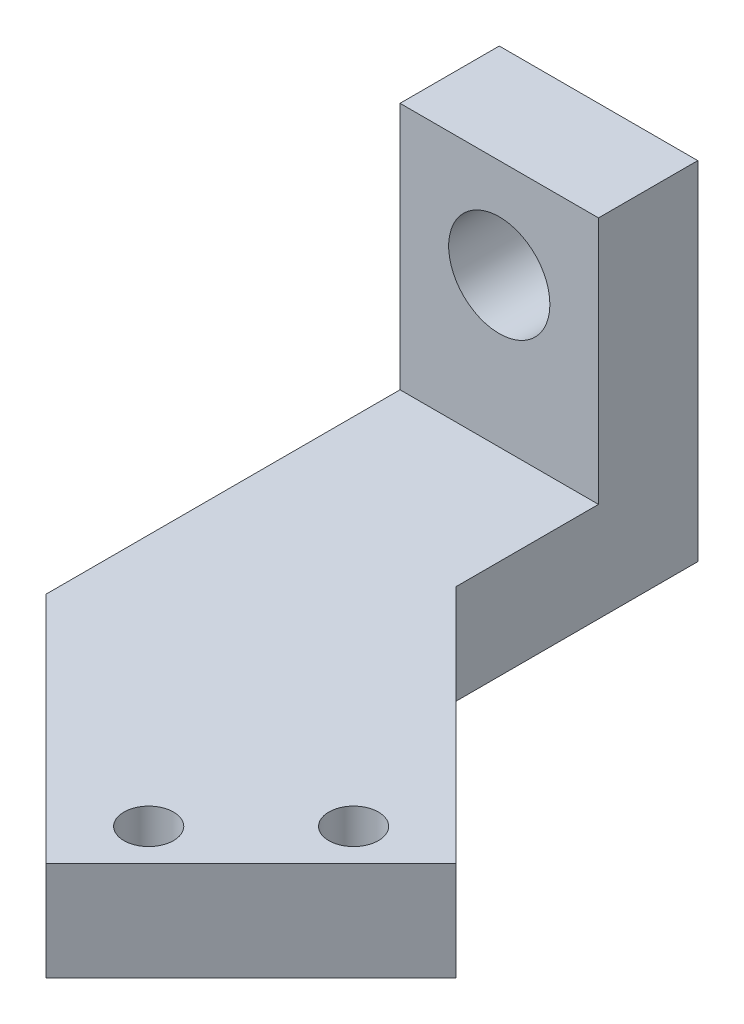
ISO-10303-21;
HEADER;
FILE_DESCRIPTION(('STEP AP214'),'2;1');
FILE_NAME('part.step','',(''),(''),'','','');
FILE_SCHEMA(('AUTOMOTIVE_DESIGN { 1 0 10303 214 1 1 1 1 }'));
ENDSEC;
DATA;
#1=APPLICATION_CONTEXT('core data for automotive mechanical design processes');
#2=APPLICATION_PROTOCOL_DEFINITION('international standard','automotive_design',2000,#1);
#3=PRODUCT_CONTEXT('',#1,'mechanical');
#4=PRODUCT('Part','Part','',(#3));
#5=PRODUCT_RELATED_PRODUCT_CATEGORY('part','',(#4));
#6=PRODUCT_DEFINITION_FORMATION('','',#4);
#7=PRODUCT_DEFINITION_CONTEXT('part definition',#1,'design');
#8=PRODUCT_DEFINITION('design','',#6,#7);
#9=PRODUCT_DEFINITION_SHAPE('','',#8);
#10=(LENGTH_UNIT() NAMED_UNIT(*) SI_UNIT(.MILLI.,.METRE.));
#11=(NAMED_UNIT(*) PLANE_ANGLE_UNIT() SI_UNIT($,.RADIAN.));
#12=(NAMED_UNIT(*) SI_UNIT($,.STERADIAN.) SOLID_ANGLE_UNIT());
#13=UNCERTAINTY_MEASURE_WITH_UNIT(LENGTH_MEASURE(1.E-05),#10,'distance_accuracy_value','');
#14=(GEOMETRIC_REPRESENTATION_CONTEXT(3) GLOBAL_UNCERTAINTY_ASSIGNED_CONTEXT((#13)) GLOBAL_UNIT_ASSIGNED_CONTEXT((#10,
#11,#12)) REPRESENTATION_CONTEXT('',''));
#15=CARTESIAN_POINT('',(0.,0.,0.));
#16=DIRECTION('',(0.,0.,1.));
#17=DIRECTION('',(1.,0.,0.));
#18=AXIS2_PLACEMENT_3D('',#15,#16,#17);
#19=CARTESIAN_POINT('',(0.,0.,10.));
#20=DIRECTION('',(0.,0.,1.));
#21=DIRECTION('',(1.,0.,0.));
#22=AXIS2_PLACEMENT_3D('',#19,#20,#21);
#23=PLANE('',#22);
#24=DIRECTION('',(0.,-1.,0.));
#25=VECTOR('',#24,1.);
#26=CARTESIAN_POINT('',(-10.,-10.,10.));
#27=LINE('',#26,#25);
#28=CARTESIAN_POINT('',(-10.,10.,10.));
#29=VERTEX_POINT('',#28);
#30=CARTESIAN_POINT('',(-10.,-15.,10.));
#31=VERTEX_POINT('',#30);
#32=EDGE_CURVE('E104',#29,#31,#27,.T.);
#33=ORIENTED_EDGE('',*,*,#32,.T.);
#34=DIRECTION('',(1.,0.,0.));
#35=VECTOR('',#34,1.);
#36=CARTESIAN_POINT('',(-10.,-15.,10.));
#37=LINE('',#36,#35);
#38=CARTESIAN_POINT('',(10.,-15.,10.));
#39=VERTEX_POINT('',#38);
#40=EDGE_CURVE('E116',#31,#39,#37,.T.);
#41=ORIENTED_EDGE('',*,*,#40,.T.);
#42=DIRECTION('',(0.,1.,0.));
#43=VECTOR('',#42,1.);
#44=CARTESIAN_POINT('',(10.,-15.,10.));
#45=LINE('',#44,#43);
#46=CARTESIAN_POINT('',(10.,10.,10.));
#47=VERTEX_POINT('',#46);
#48=EDGE_CURVE('E109',#39,#47,#45,.T.);
#49=ORIENTED_EDGE('',*,*,#48,.T.);
#50=DIRECTION('',(-1.,0.,0.));
#51=VECTOR('',#50,1.);
#52=CARTESIAN_POINT('',(10.,10.,10.));
#53=LINE('',#52,#51);
#54=EDGE_CURVE('E72',#47,#29,#53,.T.);
#55=ORIENTED_EDGE('',*,*,#54,.T.);
#56=EDGE_LOOP('',(#33,#41,#49,#55));
#57=FACE_BOUND('',#56,.T.);
#58=CARTESIAN_POINT('',(0.,0.,10.));
#59=DIRECTION('',(0.,0.,1.));
#60=DIRECTION('',(1.,0.,0.));
#61=AXIS2_PLACEMENT_3D('',#58,#59,#60);
#62=CIRCLE('',#61,5.1);
#63=CARTESIAN_POINT('',(5.1,0.,10.));
#64=VERTEX_POINT('',#63);
#65=EDGE_CURVE('E97',#64,#64,#62,.T.);
#66=ORIENTED_EDGE('',*,*,#65,.F.);
#67=EDGE_LOOP('',(#66));
#68=FACE_BOUND('',#67,.T.);
#69=ADVANCED_FACE('F47',(#57,#68),#23,.T.);
#70=CARTESIAN_POINT('',(0.,0.,0.));
#71=DIRECTION('',(0.,0.,1.));
#72=DIRECTION('',(1.,0.,0.));
#73=AXIS2_PLACEMENT_3D('',#70,#71,#72);
#74=PLANE('',#73);
#75=DIRECTION('',(0.,-1.,0.));
#76=VECTOR('',#75,1.);
#77=CARTESIAN_POINT('',(-10.,-10.,0.));
#78=LINE('',#77,#76);
#79=CARTESIAN_POINT('',(-10.,10.,0.));
#80=VERTEX_POINT('',#79);
#81=CARTESIAN_POINT('',(-10.,-25.,0.));
#82=VERTEX_POINT('',#81);
#83=EDGE_CURVE('E85',#80,#82,#78,.T.);
#84=ORIENTED_EDGE('',*,*,#83,.F.);
#85=DIRECTION('',(-1.,0.,0.));
#86=VECTOR('',#85,1.);
#87=CARTESIAN_POINT('',(10.,10.,0.));
#88=LINE('',#87,#86);
#89=CARTESIAN_POINT('',(10.,10.,0.));
#90=VERTEX_POINT('',#89);
#91=EDGE_CURVE('E90',#90,#80,#88,.T.);
#92=ORIENTED_EDGE('',*,*,#91,.F.);
#93=DIRECTION('',(0.,1.,0.));
#94=VECTOR('',#93,1.);
#95=CARTESIAN_POINT('',(10.,-10.,0.));
#96=LINE('',#95,#94);
#97=CARTESIAN_POINT('',(10.,-25.,0.));
#98=VERTEX_POINT('',#97);
#99=EDGE_CURVE('E96',#98,#90,#96,.T.);
#100=ORIENTED_EDGE('',*,*,#99,.F.);
#101=DIRECTION('',(1.,0.,0.));
#102=VECTOR('',#101,1.);
#103=CARTESIAN_POINT('',(-10.,-25.,0.));
#104=LINE('',#103,#102);
#105=EDGE_CURVE('E93',#82,#98,#104,.T.);
#106=ORIENTED_EDGE('',*,*,#105,.F.);
#107=EDGE_LOOP('',(#84,#92,#100,#106));
#108=FACE_BOUND('',#107,.T.);
#109=CARTESIAN_POINT('',(0.,0.,0.));
#110=DIRECTION('',(0.,0.,1.));
#111=DIRECTION('',(1.,0.,0.));
#112=AXIS2_PLACEMENT_3D('',#109,#110,#111);
#113=CIRCLE('',#112,5.1);
#114=CARTESIAN_POINT('',(5.1,0.,0.));
#115=VERTEX_POINT('',#114);
#116=EDGE_CURVE('E122',#115,#115,#113,.T.);
#117=ORIENTED_EDGE('',*,*,#116,.T.);
#118=EDGE_LOOP('',(#117));
#119=FACE_BOUND('',#118,.T.);
#120=ADVANCED_FACE('F87',(#108,#119),#74,.F.);
#121=CARTESIAN_POINT('',(-10.,-10.,10.));
#122=DIRECTION('',(1.,0.,0.));
#123=DIRECTION('',(0.,1.,0.));
#124=AXIS2_PLACEMENT_3D('',#121,#122,#123);
#125=PLANE('',#124);
#126=ORIENTED_EDGE('',*,*,#83,.T.);
#127=DIRECTION('',(0.,0.,-1.));
#128=VECTOR('',#127,1.);
#129=CARTESIAN_POINT('',(-10.,-25.,10.));
#130=LINE('',#129,#128);
#131=CARTESIAN_POINT('',(-9.99999999999999,-25.,45.6475180106472));
#132=VERTEX_POINT('',#131);
#133=EDGE_CURVE('E63',#132,#82,#130,.T.);
#134=ORIENTED_EDGE('',*,*,#133,.F.);
#135=DIRECTION('',(0.,-1.,0.));
#136=VECTOR('',#135,1.);
#137=CARTESIAN_POINT('',(-9.99999999999999,10.001,45.6475180106472));
#138=LINE('',#137,#136);
#139=CARTESIAN_POINT('',(-9.99999999999999,-15.,45.6475180106472));
#140=VERTEX_POINT('',#139);
#141=EDGE_CURVE('E179',#140,#132,#138,.T.);
#142=ORIENTED_EDGE('',*,*,#141,.F.);
#143=DIRECTION('',(0.,0.,1.));
#144=VECTOR('',#143,1.);
#145=CARTESIAN_POINT('',(-10.,-15.,10.));
#146=LINE('',#145,#144);
#147=EDGE_CURVE('E190',#31,#140,#146,.T.);
#148=ORIENTED_EDGE('',*,*,#147,.F.);
#149=ORIENTED_EDGE('',*,*,#32,.F.);
#150=DIRECTION('',(0.,0.,-1.));
#151=VECTOR('',#150,1.);
#152=CARTESIAN_POINT('',(-10.,10.,10.));
#153=LINE('',#152,#151);
#154=EDGE_CURVE('E56',#29,#80,#153,.T.);
#155=ORIENTED_EDGE('',*,*,#154,.T.);
#156=EDGE_LOOP('',(#126,#134,#142,#148,#149,#155));
#157=FACE_BOUND('',#156,.T.);
#158=ADVANCED_FACE('F49',(#157),#125,.F.);
#159=CARTESIAN_POINT('',(10.,-10.,10.));
#160=DIRECTION('',(-1.,0.,0.));
#161=DIRECTION('',(0.,0.,1.));
#162=AXIS2_PLACEMENT_3D('',#159,#160,#161);
#163=PLANE('',#162);
#164=ORIENTED_EDGE('',*,*,#99,.T.);
#165=DIRECTION('',(0.,0.,-1.));
#166=VECTOR('',#165,1.);
#167=CARTESIAN_POINT('',(10.,10.,10.));
#168=LINE('',#167,#166);
#169=EDGE_CURVE('E11',#47,#90,#168,.T.);
#170=ORIENTED_EDGE('',*,*,#169,.F.);
#171=ORIENTED_EDGE('',*,*,#48,.F.);
#172=DIRECTION('',(0.,0.,-1.));
#173=VECTOR('',#172,1.);
#174=CARTESIAN_POINT('',(10.,-15.,10.));
#175=LINE('',#174,#173);
#176=CARTESIAN_POINT('',(10.,-15.,24.3524819893527));
#177=VERTEX_POINT('',#176);
#178=EDGE_CURVE('E186',#177,#39,#175,.T.);
#179=ORIENTED_EDGE('',*,*,#178,.F.);
#180=DIRECTION('',(0.,-1.,0.));
#181=VECTOR('',#180,1.);
#182=CARTESIAN_POINT('',(10.,10.001,24.3524819893527));
#183=LINE('',#182,#181);
#184=CARTESIAN_POINT('',(10.,-25.,24.3524819893527));
#185=VERTEX_POINT('',#184);
#186=EDGE_CURVE('E191',#177,#185,#183,.T.);
#187=ORIENTED_EDGE('',*,*,#186,.T.);
#188=DIRECTION('',(0.,0.,1.));
#189=VECTOR('',#188,1.);
#190=CARTESIAN_POINT('',(10.,-25.,0.));
#191=LINE('',#190,#189);
#192=EDGE_CURVE('E126',#98,#185,#191,.T.);
#193=ORIENTED_EDGE('',*,*,#192,.F.);
#194=EDGE_LOOP('',(#164,#170,#171,#179,#187,#193));
#195=FACE_BOUND('',#194,.T.);
#196=ADVANCED_FACE('F234',(#195),#163,.F.);
#197=CARTESIAN_POINT('',(10.,10.,10.));
#198=DIRECTION('',(0.,-1.,0.));
#199=DIRECTION('',(1.,0.,0.));
#200=AXIS2_PLACEMENT_3D('',#197,#198,#199);
#201=PLANE('',#200);
#202=ORIENTED_EDGE('',*,*,#91,.T.);
#203=ORIENTED_EDGE('',*,*,#154,.F.);
#204=ORIENTED_EDGE('',*,*,#54,.F.);
#205=ORIENTED_EDGE('',*,*,#169,.T.);
#206=EDGE_LOOP('',(#202,#203,#204,#205));
#207=FACE_BOUND('',#206,.T.);
#208=ADVANCED_FACE('F100',(#207),#201,.F.);
#209=CARTESIAN_POINT('',(0.,0.,10.));
#210=DIRECTION('',(0.,0.,-1.));
#211=DIRECTION('',(-1.,0.,0.));
#212=AXIS2_PLACEMENT_3D('',#209,#210,#211);
#213=CYLINDRICAL_SURFACE('',#212,5.1);
#214=ORIENTED_EDGE('',*,*,#65,.T.);
#215=EDGE_LOOP('',(#214));
#216=FACE_BOUND('',#215,.T.);
#217=ORIENTED_EDGE('',*,*,#116,.F.);
#218=EDGE_LOOP('',(#217));
#219=FACE_BOUND('',#218,.T.);
#220=ADVANCED_FACE('F249',(#216,#219),#213,.F.);
#221=CARTESIAN_POINT('',(0.,-15.,0.));
#222=DIRECTION('',(0.,1.,0.));
#223=DIRECTION('',(0.,0.,1.));
#224=AXIS2_PLACEMENT_3D('',#221,#222,#223);
#225=PLANE('',#224);
#226=ORIENTED_EDGE('',*,*,#147,.T.);
#227=DIRECTION('',(0.707106781186548,0.,0.707106781186547));
#228=VECTOR('',#227,1.);
#229=CARTESIAN_POINT('',(13.5057395206631,-15.,69.1532575313102));
#230=LINE('',#229,#228);
#231=CARTESIAN_POINT('',(13.5057395206631,-15.,69.1532575313102));
#232=VERTEX_POINT('',#231);
#233=EDGE_CURVE('E155',#140,#232,#230,.T.);
#234=ORIENTED_EDGE('',*,*,#233,.T.);
#235=DIRECTION('',(0.707106781186547,0.,-0.707106781186548));
#236=VECTOR('',#235,1.);
#237=CARTESIAN_POINT('',(34.1532575313103,-15.,48.505739520663));
#238=LINE('',#237,#236);
#239=CARTESIAN_POINT('',(34.1532575313103,-15.,48.505739520663));
#240=VERTEX_POINT('',#239);
#241=EDGE_CURVE('E151',#232,#240,#238,.T.);
#242=ORIENTED_EDGE('',*,*,#241,.T.);
#243=DIRECTION('',(-0.707106781186548,0.,-0.707106781186547));
#244=VECTOR('',#243,1.);
#245=CARTESIAN_POINT('',(10.3237590053236,-15.,24.6762409946764));
#246=LINE('',#245,#244);
#247=EDGE_CURVE('E146',#240,#177,#246,.T.);
#248=ORIENTED_EDGE('',*,*,#247,.T.);
#249=ORIENTED_EDGE('',*,*,#178,.T.);
#250=ORIENTED_EDGE('',*,*,#40,.F.);
#251=EDGE_LOOP('',(#226,#234,#242,#248,#249,#250));
#252=FACE_BOUND('',#251,.T.);
#253=CARTESIAN_POINT('',(15.4326054993964,-15.,60.75636450472));
#254=DIRECTION('',(0.,1.,0.));
#255=DIRECTION('',(0.,0.,1.));
#256=AXIS2_PLACEMENT_3D('',#253,#254,#255);
#257=CIRCLE('',#256,2.5);
#258=CARTESIAN_POINT('',(15.4326054993964,-15.,63.25636450472));
#259=VERTEX_POINT('',#258);
#260=EDGE_CURVE('E174',#259,#259,#257,.T.);
#261=ORIENTED_EDGE('',*,*,#260,.F.);
#262=EDGE_LOOP('',(#261));
#263=FACE_BOUND('',#262,.T.);
#264=CARTESIAN_POINT('',(25.75636450472,-15.,50.4326054993964));
#265=DIRECTION('',(0.,1.,0.));
#266=DIRECTION('',(0.,0.,1.));
#267=AXIS2_PLACEMENT_3D('',#264,#265,#266);
#268=CIRCLE('',#267,2.5);
#269=CARTESIAN_POINT('',(25.75636450472,-15.,52.9326054993964));
#270=VERTEX_POINT('',#269);
#271=EDGE_CURVE('E170',#270,#270,#268,.T.);
#272=ORIENTED_EDGE('',*,*,#271,.F.);
#273=EDGE_LOOP('',(#272));
#274=FACE_BOUND('',#273,.T.);
#275=ADVANCED_FACE('F203',(#252,#263,#274),#225,.T.);
#276=CARTESIAN_POINT('',(0.,-25.,0.));
#277=DIRECTION('',(0.,1.,0.));
#278=DIRECTION('',(0.,0.,1.));
#279=AXIS2_PLACEMENT_3D('',#276,#277,#278);
#280=PLANE('',#279);
#281=CARTESIAN_POINT('',(15.4326054993964,-25.,60.75636450472));
#282=DIRECTION('',(0.,1.,0.));
#283=DIRECTION('',(0.,0.,1.));
#284=AXIS2_PLACEMENT_3D('',#281,#282,#283);
#285=CIRCLE('',#284,2.5);
#286=CARTESIAN_POINT('',(15.4326054993964,-25.,63.25636450472));
#287=VERTEX_POINT('',#286);
#288=EDGE_CURVE('E159',#287,#287,#285,.F.);
#289=ORIENTED_EDGE('',*,*,#288,.F.);
#290=EDGE_LOOP('',(#289));
#291=FACE_BOUND('',#290,.T.);
#292=CARTESIAN_POINT('',(25.75636450472,-25.,50.4326054993964));
#293=DIRECTION('',(0.,1.,0.));
#294=DIRECTION('',(0.,0.,1.));
#295=AXIS2_PLACEMENT_3D('',#292,#293,#294);
#296=CIRCLE('',#295,2.5);
#297=CARTESIAN_POINT('',(25.75636450472,-25.,52.9326054993964));
#298=VERTEX_POINT('',#297);
#299=EDGE_CURVE('E175',#298,#298,#296,.F.);
#300=ORIENTED_EDGE('',*,*,#299,.F.);
#301=EDGE_LOOP('',(#300));
#302=FACE_BOUND('',#301,.T.);
#303=DIRECTION('',(0.707106781186548,0.,0.707106781186547));
#304=VECTOR('',#303,1.);
#305=CARTESIAN_POINT('',(13.5057395206631,-25.,69.1532575313102));
#306=LINE('',#305,#304);
#307=CARTESIAN_POINT('',(13.5057395206631,-25.,69.1532575313102));
#308=VERTEX_POINT('',#307);
#309=EDGE_CURVE('E150',#132,#308,#306,.T.);
#310=ORIENTED_EDGE('',*,*,#309,.F.);
#311=ORIENTED_EDGE('',*,*,#133,.T.);
#312=ORIENTED_EDGE('',*,*,#105,.T.);
#313=ORIENTED_EDGE('',*,*,#192,.T.);
#314=DIRECTION('',(-0.707106781186548,0.,-0.707106781186547));
#315=VECTOR('',#314,1.);
#316=CARTESIAN_POINT('',(10.3237590053236,-25.,24.6762409946764));
#317=LINE('',#316,#315);
#318=CARTESIAN_POINT('',(34.1532575313103,-25.,48.505739520663));
#319=VERTEX_POINT('',#318);
#320=EDGE_CURVE('E142',#319,#185,#317,.T.);
#321=ORIENTED_EDGE('',*,*,#320,.F.);
#322=DIRECTION('',(0.707106781186547,0.,-0.707106781186548));
#323=VECTOR('',#322,1.);
#324=CARTESIAN_POINT('',(34.1532575313103,-25.,48.505739520663));
#325=LINE('',#324,#323);
#326=EDGE_CURVE('E163',#308,#319,#325,.T.);
#327=ORIENTED_EDGE('',*,*,#326,.F.);
#328=EDGE_LOOP('',(#310,#311,#312,#313,#321,#327));
#329=FACE_BOUND('',#328,.T.);
#330=ADVANCED_FACE('F231',(#291,#302,#329),#280,.F.);
#331=CARTESIAN_POINT('',(10.3237590053236,-25.,24.6762409946764));
#332=DIRECTION('',(0.707106781186547,0.,-0.707106781186548));
#333=DIRECTION('',(-0.707106781186548,0.,-0.707106781186547));
#334=AXIS2_PLACEMENT_3D('',#331,#332,#333);
#335=PLANE('',#334);
#336=ORIENTED_EDGE('',*,*,#320,.T.);
#337=ORIENTED_EDGE('',*,*,#186,.F.);
#338=ORIENTED_EDGE('',*,*,#247,.F.);
#339=DIRECTION('',(0.,1.,0.));
#340=VECTOR('',#339,1.);
#341=CARTESIAN_POINT('',(34.1532575313103,-25.,48.505739520663));
#342=LINE('',#341,#340);
#343=EDGE_CURVE('E137',#319,#240,#342,.T.);
#344=ORIENTED_EDGE('',*,*,#343,.F.);
#345=EDGE_LOOP('',(#336,#337,#338,#344));
#346=FACE_BOUND('',#345,.T.);
#347=ADVANCED_FACE('F240',(#346),#335,.T.);
#348=CARTESIAN_POINT('',(34.1532575313103,-25.,48.505739520663));
#349=DIRECTION('',(0.707106781186548,0.,0.707106781186547));
#350=DIRECTION('',(0.707106781186547,0.,-0.707106781186548));
#351=AXIS2_PLACEMENT_3D('',#348,#349,#350);
#352=PLANE('',#351);
#353=ORIENTED_EDGE('',*,*,#241,.F.);
#354=DIRECTION('',(0.,1.,0.));
#355=VECTOR('',#354,1.);
#356=CARTESIAN_POINT('',(13.5057395206631,-25.,69.1532575313102));
#357=LINE('',#356,#355);
#358=EDGE_CURVE('E138',#308,#232,#357,.T.);
#359=ORIENTED_EDGE('',*,*,#358,.F.);
#360=ORIENTED_EDGE('',*,*,#326,.T.);
#361=ORIENTED_EDGE('',*,*,#343,.T.);
#362=EDGE_LOOP('',(#353,#359,#360,#361));
#363=FACE_BOUND('',#362,.T.);
#364=ADVANCED_FACE('F218',(#363),#352,.T.);
#365=CARTESIAN_POINT('',(13.5057395206631,-25.,69.1532575313102));
#366=DIRECTION('',(-0.707106781186547,0.,0.707106781186548));
#367=DIRECTION('',(0.707106781186548,0.,0.707106781186547));
#368=AXIS2_PLACEMENT_3D('',#365,#366,#367);
#369=PLANE('',#368);
#370=ORIENTED_EDGE('',*,*,#141,.T.);
#371=ORIENTED_EDGE('',*,*,#309,.T.);
#372=ORIENTED_EDGE('',*,*,#358,.T.);
#373=ORIENTED_EDGE('',*,*,#233,.F.);
#374=EDGE_LOOP('',(#370,#371,#372,#373));
#375=FACE_BOUND('',#374,.T.);
#376=ADVANCED_FACE('F209',(#375),#369,.T.);
#377=CARTESIAN_POINT('',(25.75636450472,-25.001,50.4326054993964));
#378=DIRECTION('',(0.,1.,0.));
#379=DIRECTION('',(0.,0.,1.));
#380=AXIS2_PLACEMENT_3D('',#377,#378,#379);
#381=CYLINDRICAL_SURFACE('',#380,2.5);
#382=ORIENTED_EDGE('',*,*,#271,.T.);
#383=EDGE_LOOP('',(#382));
#384=FACE_BOUND('',#383,.T.);
#385=ORIENTED_EDGE('',*,*,#299,.T.);
#386=EDGE_LOOP('',(#385));
#387=FACE_BOUND('',#386,.T.);
#388=ADVANCED_FACE('F295',(#384,#387),#381,.F.);
#389=CARTESIAN_POINT('',(15.4326054993964,-25.001,60.75636450472));
#390=DIRECTION('',(0.,1.,0.));
#391=DIRECTION('',(0.,0.,1.));
#392=AXIS2_PLACEMENT_3D('',#389,#390,#391);
#393=CYLINDRICAL_SURFACE('',#392,2.5);
#394=ORIENTED_EDGE('',*,*,#260,.T.);
#395=EDGE_LOOP('',(#394));
#396=FACE_BOUND('',#395,.T.);
#397=ORIENTED_EDGE('',*,*,#288,.T.);
#398=EDGE_LOOP('',(#397));
#399=FACE_BOUND('',#398,.T.);
#400=ADVANCED_FACE('F311',(#396,#399),#393,.F.);
#401=CLOSED_SHELL('',(#69,#120,#158,#196,#208,#220,#275,#330,#347,#364,#376,#388,#400));
#402=MANIFOLD_SOLID_BREP('B2',#401);
#403=ADVANCED_BREP_SHAPE_REPRESENTATION('',(#18,#402),#14);
#404=SHAPE_DEFINITION_REPRESENTATION(#9,#403);
ENDSEC;
END-ISO-10303-21;
